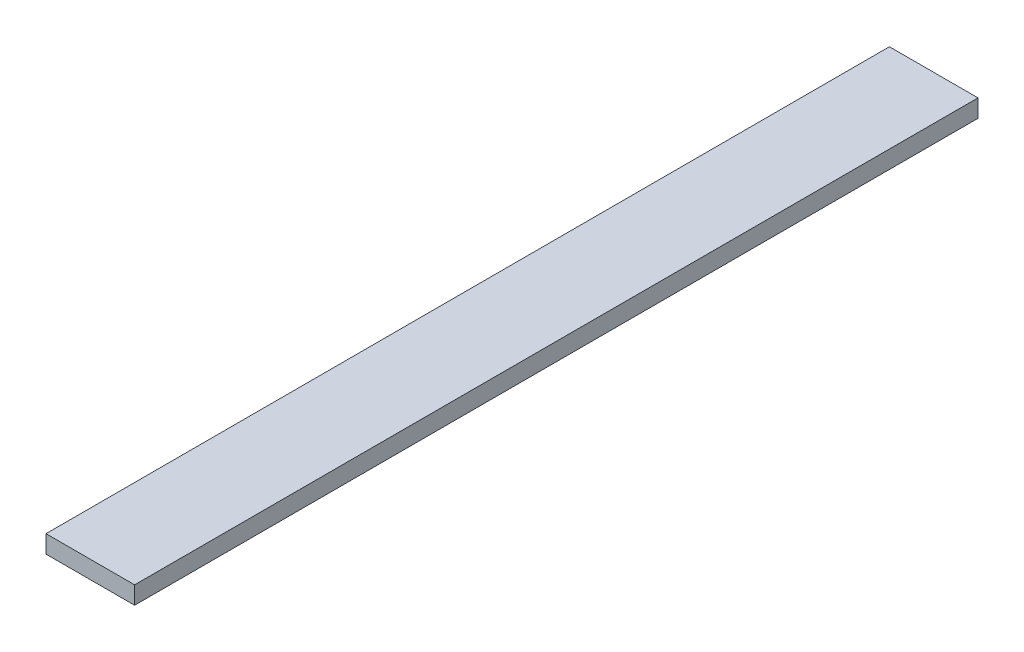
ISO-10303-21;
HEADER;
FILE_DESCRIPTION(('STEP AP214'),'2;1');
FILE_NAME('part.step','',(''),(''),'','','');
FILE_SCHEMA(('AUTOMOTIVE_DESIGN { 1 0 10303 214 1 1 1 1 }'));
ENDSEC;
DATA;
#1=APPLICATION_CONTEXT('core data for automotive mechanical design processes');
#2=APPLICATION_PROTOCOL_DEFINITION('international standard','automotive_design',2000,#1);
#3=PRODUCT_CONTEXT('',#1,'mechanical');
#4=PRODUCT('Part','Part','',(#3));
#5=PRODUCT_RELATED_PRODUCT_CATEGORY('part','',(#4));
#6=PRODUCT_DEFINITION_FORMATION('','',#4);
#7=PRODUCT_DEFINITION_CONTEXT('part definition',#1,'design');
#8=PRODUCT_DEFINITION('design','',#6,#7);
#9=PRODUCT_DEFINITION_SHAPE('','',#8);
#10=(LENGTH_UNIT() NAMED_UNIT(*) SI_UNIT(.MILLI.,.METRE.));
#11=(NAMED_UNIT(*) PLANE_ANGLE_UNIT() SI_UNIT($,.RADIAN.));
#12=(NAMED_UNIT(*) SI_UNIT($,.STERADIAN.) SOLID_ANGLE_UNIT());
#13=UNCERTAINTY_MEASURE_WITH_UNIT(LENGTH_MEASURE(1.E-05),#10,'distance_accuracy_value','');
#14=(GEOMETRIC_REPRESENTATION_CONTEXT(3) GLOBAL_UNCERTAINTY_ASSIGNED_CONTEXT((#13)) GLOBAL_UNIT_ASSIGNED_CONTEXT((#10,
#11,#12)) REPRESENTATION_CONTEXT('',''));
#15=CARTESIAN_POINT('',(0.,0.,0.));
#16=DIRECTION('',(0.,0.,1.));
#17=DIRECTION('',(1.,0.,0.));
#18=AXIS2_PLACEMENT_3D('',#15,#16,#17);
#19=CARTESIAN_POINT('',(0.,1.42999999999,0.));
#20=DIRECTION('',(0.,-1.,0.));
#21=DIRECTION('',(1.,0.,0.));
#22=AXIS2_PLACEMENT_3D('',#19,#20,#21);
#23=PLANE('',#22);
#24=DIRECTION('',(0.,0.,1.));
#25=VECTOR('',#24,1.);
#26=CARTESIAN_POINT('',(2.625,1.42999999999,0.195));
#27=LINE('',#26,#25);
#28=CARTESIAN_POINT('',(2.625,1.42999999999,0.195));
#29=VERTEX_POINT('',#28);
#30=CARTESIAN_POINT('',(2.625,1.42999999999,2.575));
#31=VERTEX_POINT('',#30);
#32=EDGE_CURVE('E80',#29,#31,#27,.T.);
#33=ORIENTED_EDGE('',*,*,#32,.T.);
#34=DIRECTION('',(-1.,0.,0.));
#35=VECTOR('',#34,1.);
#36=CARTESIAN_POINT('',(2.875,1.42999999999,2.575));
#37=LINE('',#36,#35);
#38=CARTESIAN_POINT('',(2.875,1.42999999999,2.575));
#39=VERTEX_POINT('',#38);
#40=EDGE_CURVE('E67',#31,#39,#37,.F.);
#41=ORIENTED_EDGE('',*,*,#40,.T.);
#42=DIRECTION('',(0.,0.,1.));
#43=VECTOR('',#42,1.);
#44=CARTESIAN_POINT('',(2.875,1.42999999999,0.195));
#45=LINE('',#44,#43);
#46=CARTESIAN_POINT('',(2.875,1.42999999999,0.195));
#47=VERTEX_POINT('',#46);
#48=EDGE_CURVE('E54',#39,#47,#45,.F.);
#49=ORIENTED_EDGE('',*,*,#48,.T.);
#50=DIRECTION('',(1.,0.,0.));
#51=VECTOR('',#50,1.);
#52=CARTESIAN_POINT('',(2.875,1.42999999999,0.195));
#53=LINE('',#52,#51);
#54=EDGE_CURVE('E19',#47,#29,#53,.F.);
#55=ORIENTED_EDGE('',*,*,#54,.T.);
#56=EDGE_LOOP('',(#33,#41,#49,#55));
#57=FACE_BOUND('',#56,.T.);
#58=ADVANCED_FACE('F16',(#57),#23,.F.);
#59=CARTESIAN_POINT('',(2.875,1.37999999999,0.195));
#60=DIRECTION('',(0.,0.,1.));
#61=DIRECTION('',(1.,0.,0.));
#62=AXIS2_PLACEMENT_3D('',#59,#60,#61);
#63=PLANE('',#62);
#64=DIRECTION('',(0.,-1.,0.));
#65=VECTOR('',#64,1.);
#66=CARTESIAN_POINT('',(2.875,1.37999999999,0.195));
#67=LINE('',#66,#65);
#68=CARTESIAN_POINT('',(2.875,1.37999999999,0.195));
#69=VERTEX_POINT('',#68);
#70=EDGE_CURVE('E60',#47,#69,#67,.T.);
#71=ORIENTED_EDGE('',*,*,#70,.T.);
#72=DIRECTION('',(1.,0.,0.));
#73=VECTOR('',#72,1.);
#74=CARTESIAN_POINT('',(0.,1.37999999999,0.195));
#75=LINE('',#74,#73);
#76=CARTESIAN_POINT('',(2.625,1.37999999999,0.195));
#77=VERTEX_POINT('',#76);
#78=EDGE_CURVE('E82',#77,#69,#75,.T.);
#79=ORIENTED_EDGE('',*,*,#78,.F.);
#80=DIRECTION('',(0.,1.,0.));
#81=VECTOR('',#80,1.);
#82=CARTESIAN_POINT('',(2.625,1.37999999999,0.195));
#83=LINE('',#82,#81);
#84=EDGE_CURVE('E63',#77,#29,#83,.T.);
#85=ORIENTED_EDGE('',*,*,#84,.T.);
#86=ORIENTED_EDGE('',*,*,#54,.F.);
#87=EDGE_LOOP('',(#71,#79,#85,#86));
#88=FACE_BOUND('',#87,.T.);
#89=ADVANCED_FACE('F59',(#88),#63,.F.);
#90=CARTESIAN_POINT('',(2.875,1.37999999999,0.195));
#91=DIRECTION('',(-1.,0.,0.));
#92=DIRECTION('',(0.,-1.,0.));
#93=AXIS2_PLACEMENT_3D('',#90,#91,#92);
#94=PLANE('',#93);
#95=DIRECTION('',(0.,1.,0.));
#96=VECTOR('',#95,1.);
#97=CARTESIAN_POINT('',(2.875,1.37999999999,2.575));
#98=LINE('',#97,#96);
#99=CARTESIAN_POINT('',(2.875,1.37999999999,2.575));
#100=VERTEX_POINT('',#99);
#101=EDGE_CURVE('E69',#39,#100,#98,.F.);
#102=ORIENTED_EDGE('',*,*,#101,.T.);
#103=DIRECTION('',(0.,0.,1.));
#104=VECTOR('',#103,1.);
#105=CARTESIAN_POINT('',(2.875,1.37999999999,0.));
#106=LINE('',#105,#104);
#107=EDGE_CURVE('E73',#69,#100,#106,.T.);
#108=ORIENTED_EDGE('',*,*,#107,.F.);
#109=ORIENTED_EDGE('',*,*,#70,.F.);
#110=ORIENTED_EDGE('',*,*,#48,.F.);
#111=EDGE_LOOP('',(#102,#108,#109,#110));
#112=FACE_BOUND('',#111,.T.);
#113=ADVANCED_FACE('F71',(#112),#94,.F.);
#114=CARTESIAN_POINT('',(2.875,1.37999999999,2.575));
#115=DIRECTION('',(0.,0.,-1.));
#116=DIRECTION('',(-1.,0.,0.));
#117=AXIS2_PLACEMENT_3D('',#114,#115,#116);
#118=PLANE('',#117);
#119=DIRECTION('',(0.,1.,0.));
#120=VECTOR('',#119,1.);
#121=CARTESIAN_POINT('',(2.625,1.37999999999,2.575));
#122=LINE('',#121,#120);
#123=CARTESIAN_POINT('',(2.625,1.37999999999,2.575));
#124=VERTEX_POINT('',#123);
#125=EDGE_CURVE('E34',#31,#124,#122,.F.);
#126=ORIENTED_EDGE('',*,*,#125,.T.);
#127=DIRECTION('',(1.,0.,0.));
#128=VECTOR('',#127,1.);
#129=CARTESIAN_POINT('',(0.,1.37999999999,2.575));
#130=LINE('',#129,#128);
#131=EDGE_CURVE('E25',#100,#124,#130,.F.);
#132=ORIENTED_EDGE('',*,*,#131,.F.);
#133=ORIENTED_EDGE('',*,*,#101,.F.);
#134=ORIENTED_EDGE('',*,*,#40,.F.);
#135=EDGE_LOOP('',(#126,#132,#133,#134));
#136=FACE_BOUND('',#135,.T.);
#137=ADVANCED_FACE('F88',(#136),#118,.F.);
#138=CARTESIAN_POINT('',(2.625,1.37999999999,0.195));
#139=DIRECTION('',(1.,0.,0.));
#140=DIRECTION('',(0.,1.,0.));
#141=AXIS2_PLACEMENT_3D('',#138,#139,#140);
#142=PLANE('',#141);
#143=ORIENTED_EDGE('',*,*,#84,.F.);
#144=DIRECTION('',(0.,0.,1.));
#145=VECTOR('',#144,1.);
#146=CARTESIAN_POINT('',(2.625,1.37999999999,0.));
#147=LINE('',#146,#145);
#148=EDGE_CURVE('E11',#124,#77,#147,.F.);
#149=ORIENTED_EDGE('',*,*,#148,.F.);
#150=ORIENTED_EDGE('',*,*,#125,.F.);
#151=ORIENTED_EDGE('',*,*,#32,.F.);
#152=EDGE_LOOP('',(#143,#149,#150,#151));
#153=FACE_BOUND('',#152,.T.);
#154=ADVANCED_FACE('F90',(#153),#142,.F.);
#155=CARTESIAN_POINT('',(0.,1.37999999999,0.));
#156=DIRECTION('',(0.,-1.,0.));
#157=DIRECTION('',(1.,0.,0.));
#158=AXIS2_PLACEMENT_3D('',#155,#156,#157);
#159=PLANE('',#158);
#160=ORIENTED_EDGE('',*,*,#131,.T.);
#161=ORIENTED_EDGE('',*,*,#148,.T.);
#162=ORIENTED_EDGE('',*,*,#78,.T.);
#163=ORIENTED_EDGE('',*,*,#107,.T.);
#164=EDGE_LOOP('',(#160,#161,#162,#163));
#165=FACE_BOUND('',#164,.T.);
#166=ADVANCED_FACE('F87',(#165),#159,.T.);
#167=CLOSED_SHELL('',(#58,#89,#113,#137,#154,#166));
#168=MANIFOLD_SOLID_BREP('B1',#167);
#169=ADVANCED_BREP_SHAPE_REPRESENTATION('',(#18,#168),#14);
#170=SHAPE_DEFINITION_REPRESENTATION(#9,#169);
ENDSEC;
END-ISO-10303-21;
